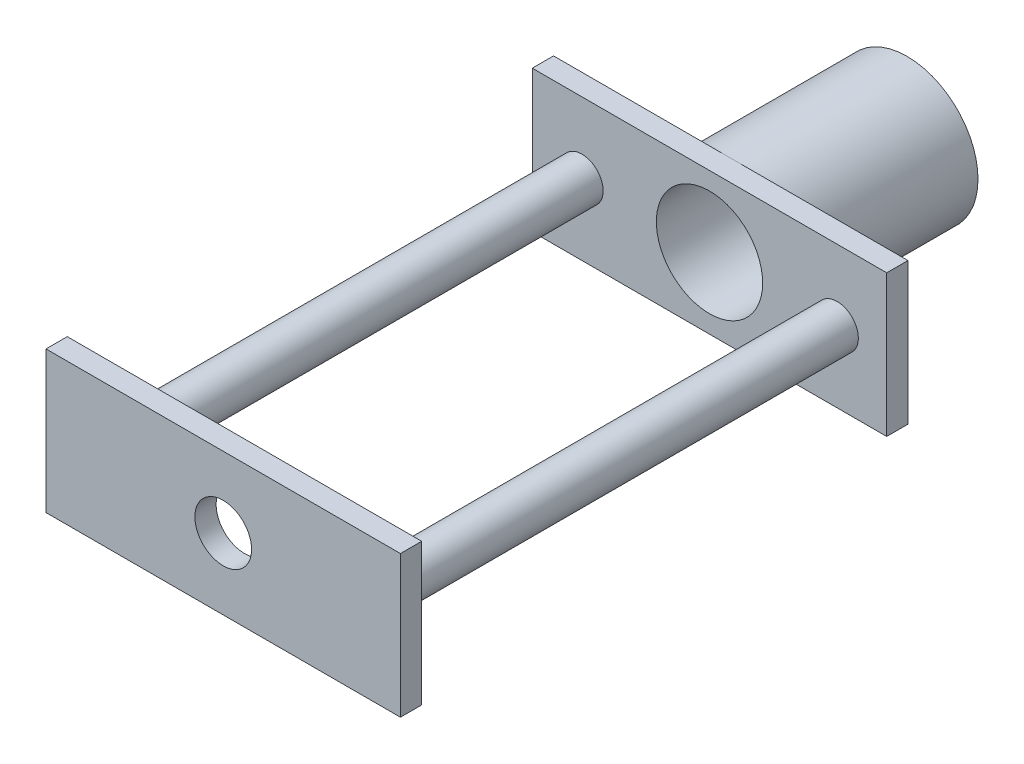
ISO-10303-21;
HEADER;
FILE_DESCRIPTION(('STEP AP214'),'2;1');
FILE_NAME('part.step','',(''),(''),'','','');
FILE_SCHEMA(('AUTOMOTIVE_DESIGN { 1 0 10303 214 1 1 1 1 }'));
ENDSEC;
DATA;
#1=APPLICATION_CONTEXT('core data for automotive mechanical design processes');
#2=APPLICATION_PROTOCOL_DEFINITION('international standard','automotive_design',2000,#1);
#3=PRODUCT_CONTEXT('',#1,'mechanical');
#4=PRODUCT('Part','Part','',(#3));
#5=PRODUCT_RELATED_PRODUCT_CATEGORY('part','',(#4));
#6=PRODUCT_DEFINITION_FORMATION('','',#4);
#7=PRODUCT_DEFINITION_CONTEXT('part definition',#1,'design');
#8=PRODUCT_DEFINITION('design','',#6,#7);
#9=PRODUCT_DEFINITION_SHAPE('','',#8);
#10=(LENGTH_UNIT() NAMED_UNIT(*) SI_UNIT(.MILLI.,.METRE.));
#11=(NAMED_UNIT(*) PLANE_ANGLE_UNIT() SI_UNIT($,.RADIAN.));
#12=(NAMED_UNIT(*) SI_UNIT($,.STERADIAN.) SOLID_ANGLE_UNIT());
#13=UNCERTAINTY_MEASURE_WITH_UNIT(LENGTH_MEASURE(1.E-05),#10,'distance_accuracy_value','');
#14=(GEOMETRIC_REPRESENTATION_CONTEXT(3) GLOBAL_UNCERTAINTY_ASSIGNED_CONTEXT((#13)) GLOBAL_UNIT_ASSIGNED_CONTEXT((#10,
#11,#12)) REPRESENTATION_CONTEXT('',''));
#15=CARTESIAN_POINT('',(0.,0.,0.));
#16=DIRECTION('',(0.,0.,1.));
#17=DIRECTION('',(1.,0.,0.));
#18=AXIS2_PLACEMENT_3D('',#15,#16,#17);
#19=CARTESIAN_POINT('',(15.5728027578941,-20.5277854535877,124.4));
#20=DIRECTION('',(0.,0.,-1.));
#21=DIRECTION('',(-1.,0.,0.));
#22=AXIS2_PLACEMENT_3D('',#19,#20,#21);
#23=CYLINDRICAL_SURFACE('',#22,50.);
#24=CARTESIAN_POINT('',(15.5728027578941,-20.5277854535877,124.4));
#25=DIRECTION('',(0.,0.,1.));
#26=DIRECTION('',(1.,0.,0.));
#27=AXIS2_PLACEMENT_3D('',#24,#25,#26);
#28=CIRCLE('',#27,50.);
#29=CARTESIAN_POINT('',(15.5728027578941,29.4722145464123,124.4));
#30=VERTEX_POINT('',#29);
#31=CARTESIAN_POINT('',(15.5728027578941,-70.5277854535877,124.4));
#32=VERTEX_POINT('',#31);
#33=EDGE_CURVE('E11',#30,#32,#28,.T.);
#34=ORIENTED_EDGE('',*,*,#33,.F.);
#35=EDGE_CURVE('E52',#32,#30,#28,.T.);
#36=ORIENTED_EDGE('',*,*,#35,.F.);
#37=EDGE_LOOP('',(#34,#36));
#38=FACE_BOUND('',#37,.T.);
#39=CARTESIAN_POINT('',(15.5728027578941,-20.5277854535877,0.));
#40=DIRECTION('',(0.,0.,1.));
#41=DIRECTION('',(1.,0.,0.));
#42=AXIS2_PLACEMENT_3D('',#39,#40,#41);
#43=CIRCLE('',#42,50.);
#44=CARTESIAN_POINT('',(65.5728027578942,-20.5277854535877,0.));
#45=VERTEX_POINT('',#44);
#46=EDGE_CURVE('E217',#45,#45,#43,.T.);
#47=ORIENTED_EDGE('',*,*,#46,.T.);
#48=EDGE_LOOP('',(#47));
#49=FACE_BOUND('',#48,.T.);
#50=ADVANCED_FACE('F43',(#38,#49),#23,.T.);
#51=CARTESIAN_POINT('',(15.5728027578941,-20.5277854535877,0.));
#52=DIRECTION('',(0.,0.,1.));
#53=DIRECTION('',(1.,0.,0.));
#54=AXIS2_PLACEMENT_3D('',#51,#52,#53);
#55=PLANE('',#54);
#56=CARTESIAN_POINT('',(15.5728027578941,-20.5277854535877,0.));
#57=DIRECTION('',(0.,0.,-1.));
#58=DIRECTION('',(-1.,0.,0.));
#59=AXIS2_PLACEMENT_3D('',#56,#57,#58);
#60=CIRCLE('',#59,32.5);
#61=CARTESIAN_POINT('',(-16.9271972421059,-20.5277854535877,0.));
#62=VERTEX_POINT('',#61);
#63=EDGE_CURVE('E210',#62,#62,#60,.T.);
#64=ORIENTED_EDGE('',*,*,#63,.F.);
#65=EDGE_LOOP('',(#64));
#66=FACE_BOUND('',#65,.T.);
#67=ORIENTED_EDGE('',*,*,#46,.F.);
#68=EDGE_LOOP('',(#67));
#69=FACE_BOUND('',#68,.T.);
#70=ADVANCED_FACE('F261',(#66,#69),#55,.F.);
#71=CARTESIAN_POINT('',(15.5728027578941,-20.5277854535877,68.4));
#72=DIRECTION('',(0.,0.,1.));
#73=DIRECTION('',(1.,0.,0.));
#74=AXIS2_PLACEMENT_3D('',#71,#72,#73);
#75=CYLINDRICAL_SURFACE('',#74,37.5);
#76=CARTESIAN_POINT('',(15.5728027578941,-20.5277854535877,68.4));
#77=DIRECTION('',(0.,0.,1.));
#78=DIRECTION('',(1.,0.,0.));
#79=AXIS2_PLACEMENT_3D('',#76,#77,#78);
#80=CIRCLE('',#79,37.5);
#81=CARTESIAN_POINT('',(53.0728027578941,-20.5277854535877,68.4));
#82=VERTEX_POINT('',#81);
#83=EDGE_CURVE('E214',#82,#82,#80,.T.);
#84=ORIENTED_EDGE('',*,*,#83,.F.);
#85=EDGE_LOOP('',(#84));
#86=FACE_BOUND('',#85,.T.);
#87=CARTESIAN_POINT('',(15.5728027578941,-20.5277854535877,139.4));
#88=DIRECTION('',(0.,0.,1.));
#89=DIRECTION('',(1.,0.,0.));
#90=AXIS2_PLACEMENT_3D('',#87,#88,#89);
#91=CIRCLE('',#90,37.5);
#92=CARTESIAN_POINT('',(53.0728027578942,-20.5277854535877,139.4));
#93=VERTEX_POINT('',#92);
#94=EDGE_CURVE('E157',#93,#93,#91,.T.);
#95=ORIENTED_EDGE('',*,*,#94,.T.);
#96=EDGE_LOOP('',(#95));
#97=FACE_BOUND('',#96,.T.);
#98=ADVANCED_FACE('F255',(#86,#97),#75,.F.);
#99=CARTESIAN_POINT('',(15.5728027578941,-20.5277854535877,68.4));
#100=DIRECTION('',(0.,0.,1.));
#101=DIRECTION('',(1.,0.,0.));
#102=AXIS2_PLACEMENT_3D('',#99,#100,#101);
#103=PLANE('',#102);
#104=CARTESIAN_POINT('',(15.5728027578941,-20.5277854535877,68.4));
#105=DIRECTION('',(0.,0.,1.));
#106=DIRECTION('',(1.,0.,0.));
#107=AXIS2_PLACEMENT_3D('',#104,#105,#106);
#108=CIRCLE('',#107,32.5);
#109=CARTESIAN_POINT('',(48.0728027578941,-20.5277854535877,68.4));
#110=VERTEX_POINT('',#109);
#111=EDGE_CURVE('E46',#110,#110,#108,.T.);
#112=ORIENTED_EDGE('',*,*,#111,.F.);
#113=EDGE_LOOP('',(#112));
#114=FACE_BOUND('',#113,.T.);
#115=ORIENTED_EDGE('',*,*,#83,.T.);
#116=EDGE_LOOP('',(#115));
#117=FACE_BOUND('',#116,.T.);
#118=ADVANCED_FACE('F252',(#114,#117),#103,.T.);
#119=CARTESIAN_POINT('',(15.5728027578941,-20.5277854535877,69.4));
#120=DIRECTION('',(0.,0.,-1.));
#121=DIRECTION('',(-1.,0.,0.));
#122=AXIS2_PLACEMENT_3D('',#119,#120,#121);
#123=CYLINDRICAL_SURFACE('',#122,32.5);
#124=ORIENTED_EDGE('',*,*,#111,.T.);
#125=EDGE_LOOP('',(#124));
#126=FACE_BOUND('',#125,.T.);
#127=ORIENTED_EDGE('',*,*,#63,.T.);
#128=EDGE_LOOP('',(#127));
#129=FACE_BOUND('',#128,.T.);
#130=ADVANCED_FACE('F249',(#126,#129),#123,.F.);
#131=CARTESIAN_POINT('',(0.,0.,139.4));
#132=DIRECTION('',(0.,0.,1.));
#133=DIRECTION('',(1.,0.,0.));
#134=AXIS2_PLACEMENT_3D('',#131,#132,#133);
#135=PLANE('',#134);
#136=CARTESIAN_POINT('',(-74.4271972421059,-20.5277854535877,139.4));
#137=DIRECTION('',(0.,0.,1.));
#138=DIRECTION('',(1.,0.,0.));
#139=AXIS2_PLACEMENT_3D('',#136,#137,#138);
#140=CIRCLE('',#139,15.);
#141=CARTESIAN_POINT('',(-59.4271972421059,-20.5277854535877,139.4));
#142=VERTEX_POINT('',#141);
#143=EDGE_CURVE('E138',#142,#142,#140,.T.);
#144=ORIENTED_EDGE('',*,*,#143,.F.);
#145=EDGE_LOOP('',(#144));
#146=FACE_BOUND('',#145,.T.);
#147=CARTESIAN_POINT('',(105.572802757894,-20.5277854535877,139.4));
#148=DIRECTION('',(0.,0.,1.));
#149=DIRECTION('',(1.,0.,0.));
#150=AXIS2_PLACEMENT_3D('',#147,#148,#149);
#151=CIRCLE('',#150,15.);
#152=CARTESIAN_POINT('',(120.572802757894,-20.5277854535877,139.4));
#153=VERTEX_POINT('',#152);
#154=EDGE_CURVE('E151',#153,#153,#151,.T.);
#155=ORIENTED_EDGE('',*,*,#154,.F.);
#156=EDGE_LOOP('',(#155));
#157=FACE_BOUND('',#156,.T.);
#158=ORIENTED_EDGE('',*,*,#94,.F.);
#159=EDGE_LOOP('',(#158));
#160=FACE_BOUND('',#159,.T.);
#161=DIRECTION('',(0.,-1.,0.));
#162=VECTOR('',#161,1.);
#163=CARTESIAN_POINT('',(-109.427197242106,29.4722145464123,139.4));
#164=LINE('',#163,#162);
#165=CARTESIAN_POINT('',(-109.427197242106,29.4722145464123,139.4));
#166=VERTEX_POINT('',#165);
#167=CARTESIAN_POINT('',(-109.427197242106,-70.5277854535877,139.4));
#168=VERTEX_POINT('',#167);
#169=EDGE_CURVE('E165',#166,#168,#164,.T.);
#170=ORIENTED_EDGE('',*,*,#169,.T.);
#171=DIRECTION('',(1.,0.,0.));
#172=VECTOR('',#171,1.);
#173=CARTESIAN_POINT('',(-109.427197242106,-70.5277854535877,139.4));
#174=LINE('',#173,#172);
#175=CARTESIAN_POINT('',(140.572802757894,-70.5277854535877,139.4));
#176=VERTEX_POINT('',#175);
#177=EDGE_CURVE('E169',#168,#176,#174,.T.);
#178=ORIENTED_EDGE('',*,*,#177,.T.);
#179=DIRECTION('',(0.,1.,0.));
#180=VECTOR('',#179,1.);
#181=CARTESIAN_POINT('',(140.572802757894,29.4722145464123,139.4));
#182=LINE('',#181,#180);
#183=CARTESIAN_POINT('',(140.572802757894,29.4722145464123,139.4));
#184=VERTEX_POINT('',#183);
#185=EDGE_CURVE('E173',#176,#184,#182,.T.);
#186=ORIENTED_EDGE('',*,*,#185,.T.);
#187=DIRECTION('',(-1.,0.,0.));
#188=VECTOR('',#187,1.);
#189=CARTESIAN_POINT('',(-109.427197242106,29.4722145464123,139.4));
#190=LINE('',#189,#188);
#191=EDGE_CURVE('E176',#184,#166,#190,.T.);
#192=ORIENTED_EDGE('',*,*,#191,.T.);
#193=EDGE_LOOP('',(#170,#178,#186,#192));
#194=FACE_BOUND('',#193,.T.);
#195=ADVANCED_FACE('F265',(#146,#157,#160,#194),#135,.T.);
#196=CARTESIAN_POINT('',(-109.427197242106,29.4722145464123,139.4));
#197=DIRECTION('',(0.,-1.,0.));
#198=DIRECTION('',(0.,0.,-1.));
#199=AXIS2_PLACEMENT_3D('',#196,#197,#198);
#200=PLANE('',#199);
#201=DIRECTION('',(-1.,0.,0.));
#202=VECTOR('',#201,1.);
#203=CARTESIAN_POINT('',(-109.427197242106,29.4722145464123,124.4));
#204=LINE('',#203,#202);
#205=CARTESIAN_POINT('',(140.572802757894,29.4722145464123,124.4));
#206=VERTEX_POINT('',#205);
#207=EDGE_CURVE('E170',#206,#30,#204,.T.);
#208=ORIENTED_EDGE('',*,*,#207,.T.);
#209=CARTESIAN_POINT('',(-109.427197242106,29.4722145464123,124.4));
#210=VERTEX_POINT('',#209);
#211=EDGE_CURVE('E191',#30,#210,#204,.T.);
#212=ORIENTED_EDGE('',*,*,#211,.T.);
#213=DIRECTION('',(0.,0.,-1.));
#214=VECTOR('',#213,1.);
#215=CARTESIAN_POINT('',(-109.427197242106,29.4722145464123,139.4));
#216=LINE('',#215,#214);
#217=EDGE_CURVE('E179',#166,#210,#216,.T.);
#218=ORIENTED_EDGE('',*,*,#217,.F.);
#219=ORIENTED_EDGE('',*,*,#191,.F.);
#220=DIRECTION('',(0.,0.,-1.));
#221=VECTOR('',#220,1.);
#222=CARTESIAN_POINT('',(140.572802757894,29.4722145464123,139.4));
#223=LINE('',#222,#221);
#224=EDGE_CURVE('E198',#184,#206,#223,.T.);
#225=ORIENTED_EDGE('',*,*,#224,.T.);
#226=EDGE_LOOP('',(#208,#212,#218,#219,#225));
#227=FACE_BOUND('',#226,.T.);
#228=ADVANCED_FACE('F235',(#227),#200,.F.);
#229=CARTESIAN_POINT('',(140.572802757894,29.4722145464123,139.4));
#230=DIRECTION('',(-1.,0.,0.));
#231=DIRECTION('',(0.,0.,1.));
#232=AXIS2_PLACEMENT_3D('',#229,#230,#231);
#233=PLANE('',#232);
#234=DIRECTION('',(0.,1.,0.));
#235=VECTOR('',#234,1.);
#236=CARTESIAN_POINT('',(140.572802757894,29.4722145464123,124.4));
#237=LINE('',#236,#235);
#238=CARTESIAN_POINT('',(140.572802757894,-70.5277854535877,124.4));
#239=VERTEX_POINT('',#238);
#240=EDGE_CURVE('E188',#239,#206,#237,.T.);
#241=ORIENTED_EDGE('',*,*,#240,.T.);
#242=ORIENTED_EDGE('',*,*,#224,.F.);
#243=ORIENTED_EDGE('',*,*,#185,.F.);
#244=DIRECTION('',(0.,0.,-1.));
#245=VECTOR('',#244,1.);
#246=CARTESIAN_POINT('',(140.572802757894,-70.5277854535877,139.4));
#247=LINE('',#246,#245);
#248=EDGE_CURVE('E202',#176,#239,#247,.T.);
#249=ORIENTED_EDGE('',*,*,#248,.T.);
#250=EDGE_LOOP('',(#241,#242,#243,#249));
#251=FACE_BOUND('',#250,.T.);
#252=ADVANCED_FACE('F240',(#251),#233,.F.);
#253=CARTESIAN_POINT('',(-109.427197242106,-70.5277854535877,139.4));
#254=DIRECTION('',(0.,1.,0.));
#255=DIRECTION('',(0.,0.,1.));
#256=AXIS2_PLACEMENT_3D('',#253,#254,#255);
#257=PLANE('',#256);
#258=DIRECTION('',(1.,0.,0.));
#259=VECTOR('',#258,1.);
#260=CARTESIAN_POINT('',(-109.427197242106,-70.5277854535877,124.4));
#261=LINE('',#260,#259);
#262=CARTESIAN_POINT('',(-109.427197242106,-70.5277854535877,124.4));
#263=VERTEX_POINT('',#262);
#264=EDGE_CURVE('E184',#263,#32,#261,.T.);
#265=ORIENTED_EDGE('',*,*,#264,.T.);
#266=EDGE_CURVE('E183',#32,#239,#261,.T.);
#267=ORIENTED_EDGE('',*,*,#266,.T.);
#268=ORIENTED_EDGE('',*,*,#248,.F.);
#269=ORIENTED_EDGE('',*,*,#177,.F.);
#270=DIRECTION('',(0.,0.,-1.));
#271=VECTOR('',#270,1.);
#272=CARTESIAN_POINT('',(-109.427197242106,-70.5277854535877,139.4));
#273=LINE('',#272,#271);
#274=EDGE_CURVE('E206',#168,#263,#273,.T.);
#275=ORIENTED_EDGE('',*,*,#274,.T.);
#276=EDGE_LOOP('',(#265,#267,#268,#269,#275));
#277=FACE_BOUND('',#276,.T.);
#278=ADVANCED_FACE('F243',(#277),#257,.F.);
#279=CARTESIAN_POINT('',(-109.427197242106,29.4722145464123,139.4));
#280=DIRECTION('',(1.,0.,0.));
#281=DIRECTION('',(0.,1.,0.));
#282=AXIS2_PLACEMENT_3D('',#279,#280,#281);
#283=PLANE('',#282);
#284=DIRECTION('',(0.,-1.,0.));
#285=VECTOR('',#284,1.);
#286=CARTESIAN_POINT('',(-109.427197242106,29.4722145464123,124.4));
#287=LINE('',#286,#285);
#288=EDGE_CURVE('E164',#210,#263,#287,.T.);
#289=ORIENTED_EDGE('',*,*,#288,.T.);
#290=ORIENTED_EDGE('',*,*,#274,.F.);
#291=ORIENTED_EDGE('',*,*,#169,.F.);
#292=ORIENTED_EDGE('',*,*,#217,.T.);
#293=EDGE_LOOP('',(#289,#290,#291,#292));
#294=FACE_BOUND('',#293,.T.);
#295=ADVANCED_FACE('F273',(#294),#283,.F.);
#296=CARTESIAN_POINT('',(0.,0.,124.4));
#297=DIRECTION('',(0.,0.,1.));
#298=DIRECTION('',(1.,0.,0.));
#299=AXIS2_PLACEMENT_3D('',#296,#297,#298);
#300=PLANE('',#299);
#301=ORIENTED_EDGE('',*,*,#266,.F.);
#302=ORIENTED_EDGE('',*,*,#35,.T.);
#303=ORIENTED_EDGE('',*,*,#207,.F.);
#304=ORIENTED_EDGE('',*,*,#240,.F.);
#305=EDGE_LOOP('',(#301,#302,#303,#304));
#306=FACE_BOUND('',#305,.T.);
#307=ADVANCED_FACE('F227',(#306),#300,.F.);
#308=ORIENTED_EDGE('',*,*,#211,.F.);
#309=ORIENTED_EDGE('',*,*,#33,.T.);
#310=ORIENTED_EDGE('',*,*,#264,.F.);
#311=ORIENTED_EDGE('',*,*,#288,.F.);
#312=EDGE_LOOP('',(#308,#309,#310,#311));
#313=FACE_BOUND('',#312,.T.);
#314=ADVANCED_FACE('F231',(#313),#300,.F.);
#315=CARTESIAN_POINT('',(105.572802757894,-20.5277854535877,467.4));
#316=DIRECTION('',(0.,0.,-1.));
#317=DIRECTION('',(-1.,0.,0.));
#318=AXIS2_PLACEMENT_3D('',#315,#316,#317);
#319=CYLINDRICAL_SURFACE('',#318,15.);
#320=CARTESIAN_POINT('',(105.572802757894,-20.5277854535877,467.4));
#321=DIRECTION('',(0.,0.,1.));
#322=DIRECTION('',(1.,0.,0.));
#323=AXIS2_PLACEMENT_3D('',#320,#321,#322);
#324=CIRCLE('',#323,15.);
#325=CARTESIAN_POINT('',(120.572802757894,-20.5277854535877,467.4));
#326=VERTEX_POINT('',#325);
#327=EDGE_CURVE('E153',#326,#326,#324,.T.);
#328=ORIENTED_EDGE('',*,*,#327,.F.);
#329=EDGE_LOOP('',(#328));
#330=FACE_BOUND('',#329,.T.);
#331=ORIENTED_EDGE('',*,*,#154,.T.);
#332=EDGE_LOOP('',(#331));
#333=FACE_BOUND('',#332,.T.);
#334=ADVANCED_FACE('F341',(#330,#333),#319,.T.);
#335=CARTESIAN_POINT('',(-74.4271972421059,-20.5277854535877,467.4));
#336=DIRECTION('',(0.,0.,-1.));
#337=DIRECTION('',(-1.,0.,0.));
#338=AXIS2_PLACEMENT_3D('',#335,#336,#337);
#339=CYLINDRICAL_SURFACE('',#338,15.);
#340=CARTESIAN_POINT('',(-74.4271972421059,-20.5277854535877,467.4));
#341=DIRECTION('',(0.,0.,1.));
#342=DIRECTION('',(1.,0.,0.));
#343=AXIS2_PLACEMENT_3D('',#340,#341,#342);
#344=CIRCLE('',#343,15.);
#345=CARTESIAN_POINT('',(-59.4271972421059,-20.5277854535877,467.4));
#346=VERTEX_POINT('',#345);
#347=EDGE_CURVE('E143',#346,#346,#344,.T.);
#348=ORIENTED_EDGE('',*,*,#347,.F.);
#349=EDGE_LOOP('',(#348));
#350=FACE_BOUND('',#349,.T.);
#351=ORIENTED_EDGE('',*,*,#143,.T.);
#352=EDGE_LOOP('',(#351));
#353=FACE_BOUND('',#352,.T.);
#354=ADVANCED_FACE('F355',(#350,#353),#339,.T.);
#355=CARTESIAN_POINT('',(-109.427197242106,29.4722145464123,482.4));
#356=DIRECTION('',(1.,0.,0.));
#357=DIRECTION('',(0.,0.,-1.));
#358=AXIS2_PLACEMENT_3D('',#355,#356,#357);
#359=PLANE('',#358);
#360=DIRECTION('',(0.,-1.,0.));
#361=VECTOR('',#360,1.);
#362=CARTESIAN_POINT('',(-109.427197242106,29.4722145464123,467.4));
#363=LINE('',#362,#361);
#364=CARTESIAN_POINT('',(-109.427197242106,29.4722145464123,467.4));
#365=VERTEX_POINT('',#364);
#366=CARTESIAN_POINT('',(-109.427197242106,-70.5277854535877,467.4));
#367=VERTEX_POINT('',#366);
#368=EDGE_CURVE('E136',#365,#367,#363,.T.);
#369=ORIENTED_EDGE('',*,*,#368,.T.);
#370=DIRECTION('',(0.,0.,-1.));
#371=VECTOR('',#370,1.);
#372=CARTESIAN_POINT('',(-109.427197242106,-70.5277854535877,482.4));
#373=LINE('',#372,#371);
#374=CARTESIAN_POINT('',(-109.427197242106,-70.5277854535877,482.4));
#375=VERTEX_POINT('',#374);
#376=EDGE_CURVE('E114',#375,#367,#373,.T.);
#377=ORIENTED_EDGE('',*,*,#376,.F.);
#378=DIRECTION('',(0.,-1.,0.));
#379=VECTOR('',#378,1.);
#380=CARTESIAN_POINT('',(-109.427197242106,29.4722145464123,482.4));
#381=LINE('',#380,#379);
#382=CARTESIAN_POINT('',(-109.427197242106,29.4722145464123,482.4));
#383=VERTEX_POINT('',#382);
#384=EDGE_CURVE('E122',#383,#375,#381,.T.);
#385=ORIENTED_EDGE('',*,*,#384,.F.);
#386=DIRECTION('',(0.,0.,-1.));
#387=VECTOR('',#386,1.);
#388=CARTESIAN_POINT('',(-109.427197242106,29.4722145464123,482.4));
#389=LINE('',#388,#387);
#390=EDGE_CURVE('E510',#383,#365,#389,.T.);
#391=ORIENTED_EDGE('',*,*,#390,.T.);
#392=EDGE_LOOP('',(#369,#377,#385,#391));
#393=FACE_BOUND('',#392,.T.);
#394=ADVANCED_FACE('F134',(#393),#359,.F.);
#395=CARTESIAN_POINT('',(-109.427197242106,-70.5277854535877,482.4));
#396=DIRECTION('',(0.,1.,0.));
#397=DIRECTION('',(0.,0.,1.));
#398=AXIS2_PLACEMENT_3D('',#395,#396,#397);
#399=PLANE('',#398);
#400=DIRECTION('',(1.,0.,0.));
#401=VECTOR('',#400,1.);
#402=CARTESIAN_POINT('',(-109.427197242106,-70.5277854535877,467.4));
#403=LINE('',#402,#401);
#404=CARTESIAN_POINT('',(140.572802757894,-70.5277854535877,467.4));
#405=VERTEX_POINT('',#404);
#406=EDGE_CURVE('E513',#367,#405,#403,.T.);
#407=ORIENTED_EDGE('',*,*,#406,.T.);
#408=DIRECTION('',(0.,0.,-1.));
#409=VECTOR('',#408,1.);
#410=CARTESIAN_POINT('',(140.572802757894,-70.5277854535877,482.4));
#411=LINE('',#410,#409);
#412=CARTESIAN_POINT('',(140.572802757894,-70.5277854535877,482.4));
#413=VERTEX_POINT('',#412);
#414=EDGE_CURVE('E117',#413,#405,#411,.T.);
#415=ORIENTED_EDGE('',*,*,#414,.F.);
#416=DIRECTION('',(1.,0.,0.));
#417=VECTOR('',#416,1.);
#418=CARTESIAN_POINT('',(-109.427197242106,-70.5277854535877,482.4));
#419=LINE('',#418,#417);
#420=EDGE_CURVE('E110',#375,#413,#419,.T.);
#421=ORIENTED_EDGE('',*,*,#420,.F.);
#422=ORIENTED_EDGE('',*,*,#376,.T.);
#423=EDGE_LOOP('',(#407,#415,#421,#422));
#424=FACE_BOUND('',#423,.T.);
#425=ADVANCED_FACE('F112',(#424),#399,.F.);
#426=CARTESIAN_POINT('',(140.572802757894,29.4722145464123,482.4));
#427=DIRECTION('',(-1.,0.,0.));
#428=DIRECTION('',(0.,0.,1.));
#429=AXIS2_PLACEMENT_3D('',#426,#427,#428);
#430=PLANE('',#429);
#431=DIRECTION('',(0.,1.,0.));
#432=VECTOR('',#431,1.);
#433=CARTESIAN_POINT('',(140.572802757894,29.4722145464123,467.4));
#434=LINE('',#433,#432);
#435=CARTESIAN_POINT('',(140.572802757894,29.4722145464123,467.4));
#436=VERTEX_POINT('',#435);
#437=EDGE_CURVE('E516',#405,#436,#434,.T.);
#438=ORIENTED_EDGE('',*,*,#437,.T.);
#439=DIRECTION('',(0.,0.,-1.));
#440=VECTOR('',#439,1.);
#441=CARTESIAN_POINT('',(140.572802757894,29.4722145464123,482.4));
#442=LINE('',#441,#440);
#443=CARTESIAN_POINT('',(140.572802757894,29.4722145464123,482.4));
#444=VERTEX_POINT('',#443);
#445=EDGE_CURVE('E145',#444,#436,#442,.T.);
#446=ORIENTED_EDGE('',*,*,#445,.F.);
#447=DIRECTION('',(0.,1.,0.));
#448=VECTOR('',#447,1.);
#449=CARTESIAN_POINT('',(140.572802757894,29.4722145464123,482.4));
#450=LINE('',#449,#448);
#451=EDGE_CURVE('E121',#413,#444,#450,.T.);
#452=ORIENTED_EDGE('',*,*,#451,.F.);
#453=ORIENTED_EDGE('',*,*,#414,.T.);
#454=EDGE_LOOP('',(#438,#446,#452,#453));
#455=FACE_BOUND('',#454,.T.);
#456=ADVANCED_FACE('F378',(#455),#430,.F.);
#457=CARTESIAN_POINT('',(-109.427197242106,29.4722145464123,482.4));
#458=DIRECTION('',(0.,-1.,0.));
#459=DIRECTION('',(0.,0.,-1.));
#460=AXIS2_PLACEMENT_3D('',#457,#458,#459);
#461=PLANE('',#460);
#462=DIRECTION('',(-1.,0.,0.));
#463=VECTOR('',#462,1.);
#464=CARTESIAN_POINT('',(-109.427197242106,29.4722145464123,467.4));
#465=LINE('',#464,#463);
#466=EDGE_CURVE('E132',#436,#365,#465,.T.);
#467=ORIENTED_EDGE('',*,*,#466,.T.);
#468=ORIENTED_EDGE('',*,*,#390,.F.);
#469=DIRECTION('',(-1.,0.,0.));
#470=VECTOR('',#469,1.);
#471=CARTESIAN_POINT('',(-109.427197242106,29.4722145464123,482.4));
#472=LINE('',#471,#470);
#473=EDGE_CURVE('E127',#444,#383,#472,.T.);
#474=ORIENTED_EDGE('',*,*,#473,.F.);
#475=ORIENTED_EDGE('',*,*,#445,.T.);
#476=EDGE_LOOP('',(#467,#468,#474,#475));
#477=FACE_BOUND('',#476,.T.);
#478=ADVANCED_FACE('F385',(#477),#461,.F.);
#479=CARTESIAN_POINT('',(0.,0.,482.4));
#480=DIRECTION('',(0.,0.,1.));
#481=DIRECTION('',(1.,0.,0.));
#482=AXIS2_PLACEMENT_3D('',#479,#480,#481);
#483=PLANE('',#482);
#484=CARTESIAN_POINT('',(15.5728027578941,-20.5277854535877,482.4));
#485=DIRECTION('',(0.,0.,1.));
#486=DIRECTION('',(1.,0.,0.));
#487=AXIS2_PLACEMENT_3D('',#484,#485,#486);
#488=CIRCLE('',#487,20.);
#489=CARTESIAN_POINT('',(35.5728027578941,-20.5277854535877,482.4));
#490=VERTEX_POINT('',#489);
#491=EDGE_CURVE('E500',#490,#490,#488,.T.);
#492=ORIENTED_EDGE('',*,*,#491,.F.);
#493=EDGE_LOOP('',(#492));
#494=FACE_BOUND('',#493,.T.);
#495=ORIENTED_EDGE('',*,*,#384,.T.);
#496=ORIENTED_EDGE('',*,*,#420,.T.);
#497=ORIENTED_EDGE('',*,*,#451,.T.);
#498=ORIENTED_EDGE('',*,*,#473,.T.);
#499=EDGE_LOOP('',(#495,#496,#497,#498));
#500=FACE_BOUND('',#499,.T.);
#501=ADVANCED_FACE('F125',(#494,#500),#483,.T.);
#502=CARTESIAN_POINT('',(0.,0.,467.4));
#503=DIRECTION('',(0.,0.,1.));
#504=DIRECTION('',(1.,0.,0.));
#505=AXIS2_PLACEMENT_3D('',#502,#503,#504);
#506=PLANE('',#505);
#507=CARTESIAN_POINT('',(15.5728027578941,-20.5277854535877,467.4));
#508=DIRECTION('',(0.,0.,1.));
#509=DIRECTION('',(1.,0.,0.));
#510=AXIS2_PLACEMENT_3D('',#507,#508,#509);
#511=CIRCLE('',#510,20.);
#512=CARTESIAN_POINT('',(35.5728027578941,-20.5277854535877,467.4));
#513=VERTEX_POINT('',#512);
#514=EDGE_CURVE('E497',#513,#513,#511,.T.);
#515=ORIENTED_EDGE('',*,*,#514,.T.);
#516=EDGE_LOOP('',(#515));
#517=FACE_BOUND('',#516,.T.);
#518=ORIENTED_EDGE('',*,*,#327,.T.);
#519=EDGE_LOOP('',(#518));
#520=FACE_BOUND('',#519,.T.);
#521=ORIENTED_EDGE('',*,*,#347,.T.);
#522=EDGE_LOOP('',(#521));
#523=FACE_BOUND('',#522,.T.);
#524=ORIENTED_EDGE('',*,*,#368,.F.);
#525=ORIENTED_EDGE('',*,*,#466,.F.);
#526=ORIENTED_EDGE('',*,*,#437,.F.);
#527=ORIENTED_EDGE('',*,*,#406,.F.);
#528=EDGE_LOOP('',(#524,#525,#526,#527));
#529=FACE_BOUND('',#528,.T.);
#530=ADVANCED_FACE('F400',(#517,#520,#523,#529),#506,.F.);
#531=CARTESIAN_POINT('',(15.5728027578941,-20.5277854535877,467.4));
#532=DIRECTION('',(0.,0.,1.));
#533=DIRECTION('',(1.,0.,0.));
#534=AXIS2_PLACEMENT_3D('',#531,#532,#533);
#535=CYLINDRICAL_SURFACE('',#534,20.);
#536=ORIENTED_EDGE('',*,*,#514,.F.);
#537=EDGE_LOOP('',(#536));
#538=FACE_BOUND('',#537,.T.);
#539=ORIENTED_EDGE('',*,*,#491,.T.);
#540=EDGE_LOOP('',(#539));
#541=FACE_BOUND('',#540,.T.);
#542=ADVANCED_FACE('F408',(#538,#541),#535,.F.);
#543=CLOSED_SHELL('',(#50,#70,#98,#118,#130,#195,#228,#252,#278,#295,#307,#314,#334,#354,#394,
#425,#456,#478,#501,#530,#542));
#544=MANIFOLD_SOLID_BREP('B2',#543);
#545=ADVANCED_BREP_SHAPE_REPRESENTATION('',(#18,#544),#14);
#546=SHAPE_DEFINITION_REPRESENTATION(#9,#545);
ENDSEC;
END-ISO-10303-21;
